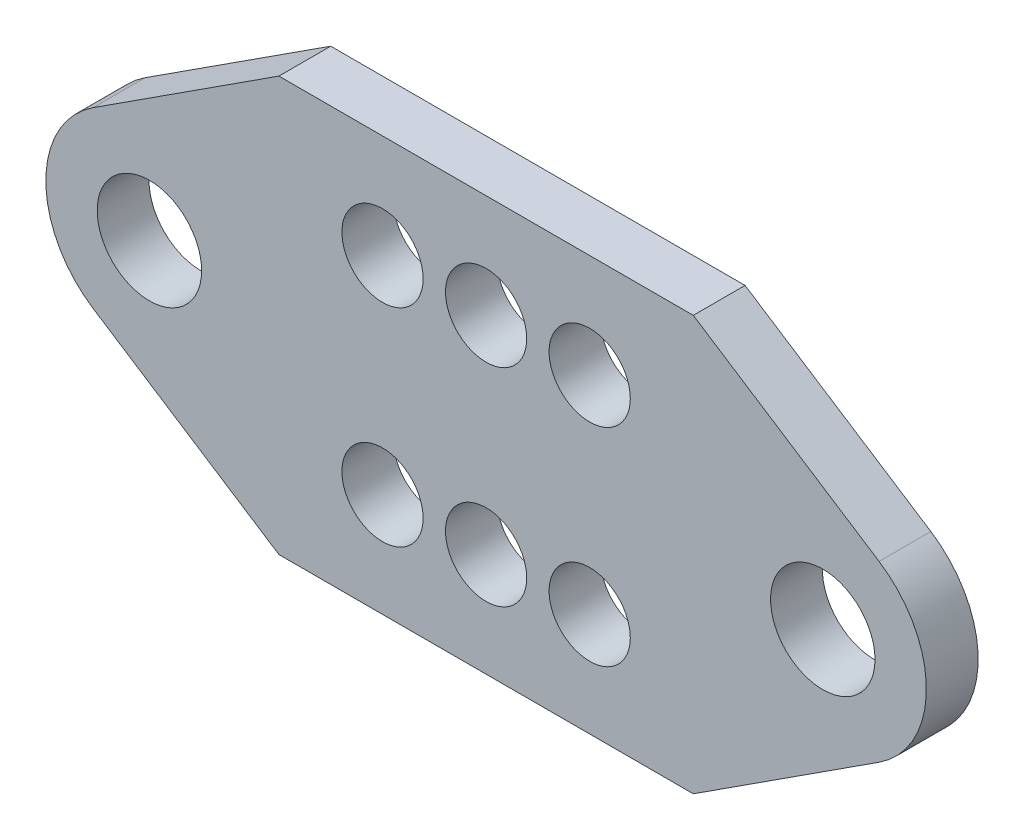
ISO-10303-21;
HEADER;
FILE_DESCRIPTION(('STEP AP214'),'2;1');
FILE_NAME('part.step','',(''),(''),'','','');
FILE_SCHEMA(('AUTOMOTIVE_DESIGN { 1 0 10303 214 1 1 1 1 }'));
ENDSEC;
DATA;
#1=APPLICATION_CONTEXT('core data for automotive mechanical design processes');
#2=APPLICATION_PROTOCOL_DEFINITION('international standard','automotive_design',2000,#1);
#3=PRODUCT_CONTEXT('',#1,'mechanical');
#4=PRODUCT('Part','Part','',(#3));
#5=PRODUCT_RELATED_PRODUCT_CATEGORY('part','',(#4));
#6=PRODUCT_DEFINITION_FORMATION('','',#4);
#7=PRODUCT_DEFINITION_CONTEXT('part definition',#1,'design');
#8=PRODUCT_DEFINITION('design','',#6,#7);
#9=PRODUCT_DEFINITION_SHAPE('','',#8);
#10=(LENGTH_UNIT() NAMED_UNIT(*) SI_UNIT(.MILLI.,.METRE.));
#11=(NAMED_UNIT(*) PLANE_ANGLE_UNIT() SI_UNIT($,.RADIAN.));
#12=(NAMED_UNIT(*) SI_UNIT($,.STERADIAN.) SOLID_ANGLE_UNIT());
#13=UNCERTAINTY_MEASURE_WITH_UNIT(LENGTH_MEASURE(1.E-05),#10,'distance_accuracy_value','');
#14=(GEOMETRIC_REPRESENTATION_CONTEXT(3) GLOBAL_UNCERTAINTY_ASSIGNED_CONTEXT((#13)) GLOBAL_UNIT_ASSIGNED_CONTEXT((#10,
#11,#12)) REPRESENTATION_CONTEXT('',''));
#15=CARTESIAN_POINT('',(0.,0.,0.));
#16=DIRECTION('',(0.,0.,1.));
#17=DIRECTION('',(1.,0.,0.));
#18=AXIS2_PLACEMENT_3D('',#15,#16,#17);
#19=CARTESIAN_POINT('',(-16.343884004258,0.,0.));
#20=DIRECTION('',(0.,0.,1.));
#21=DIRECTION('',(1.,0.,0.));
#22=AXIS2_PLACEMENT_3D('',#19,#20,#21);
#23=PLANE('',#22);
#24=CARTESIAN_POINT('',(20.6375,0.,0.));
#25=DIRECTION('',(0.,0.,1.));
#26=DIRECTION('',(1.,0.,0.));
#27=AXIS2_PLACEMENT_3D('',#24,#25,#26);
#28=CIRCLE('',#27,3.2004);
#29=CARTESIAN_POINT('',(23.8379,0.,0.));
#30=VERTEX_POINT('',#29);
#31=EDGE_CURVE('E167',#30,#30,#28,.T.);
#32=ORIENTED_EDGE('',*,*,#31,.T.);
#33=EDGE_LOOP('',(#32));
#34=FACE_BOUND('',#33,.T.);
#35=CARTESIAN_POINT('',(-20.6375,0.,0.));
#36=DIRECTION('',(0.,0.,1.));
#37=DIRECTION('',(1.,0.,0.));
#38=AXIS2_PLACEMENT_3D('',#35,#36,#37);
#39=CIRCLE('',#38,3.2004);
#40=CARTESIAN_POINT('',(-17.4371,0.,0.));
#41=VERTEX_POINT('',#40);
#42=EDGE_CURVE('E170',#41,#41,#39,.T.);
#43=ORIENTED_EDGE('',*,*,#42,.T.);
#44=EDGE_LOOP('',(#43));
#45=FACE_BOUND('',#44,.T.);
#46=CARTESIAN_POINT('',(6.35,-6.35,0.));
#47=DIRECTION('',(0.,0.,1.));
#48=DIRECTION('',(1.,0.,0.));
#49=AXIS2_PLACEMENT_3D('',#46,#47,#48);
#50=CIRCLE('',#49,2.4892);
#51=CARTESIAN_POINT('',(8.8392,-6.35,0.));
#52=VERTEX_POINT('',#51);
#53=EDGE_CURVE('E173',#52,#52,#50,.T.);
#54=ORIENTED_EDGE('',*,*,#53,.T.);
#55=EDGE_LOOP('',(#54));
#56=FACE_BOUND('',#55,.T.);
#57=CARTESIAN_POINT('',(0.,-6.35,0.));
#58=DIRECTION('',(0.,0.,1.));
#59=DIRECTION('',(1.,0.,0.));
#60=AXIS2_PLACEMENT_3D('',#57,#58,#59);
#61=CIRCLE('',#60,2.4892);
#62=CARTESIAN_POINT('',(2.4892,-6.35,0.));
#63=VERTEX_POINT('',#62);
#64=EDGE_CURVE('E176',#63,#63,#61,.T.);
#65=ORIENTED_EDGE('',*,*,#64,.T.);
#66=EDGE_LOOP('',(#65));
#67=FACE_BOUND('',#66,.T.);
#68=CARTESIAN_POINT('',(-6.35,-6.35,0.));
#69=DIRECTION('',(0.,0.,1.));
#70=DIRECTION('',(1.,0.,0.));
#71=AXIS2_PLACEMENT_3D('',#68,#69,#70);
#72=CIRCLE('',#71,2.4892);
#73=CARTESIAN_POINT('',(-3.8608,-6.35,0.));
#74=VERTEX_POINT('',#73);
#75=EDGE_CURVE('E179',#74,#74,#72,.T.);
#76=ORIENTED_EDGE('',*,*,#75,.T.);
#77=EDGE_LOOP('',(#76));
#78=FACE_BOUND('',#77,.T.);
#79=CARTESIAN_POINT('',(-6.35,6.35,0.));
#80=DIRECTION('',(0.,0.,1.));
#81=DIRECTION('',(1.,0.,0.));
#82=AXIS2_PLACEMENT_3D('',#79,#80,#81);
#83=CIRCLE('',#82,2.4892);
#84=CARTESIAN_POINT('',(-3.8608,6.35,0.));
#85=VERTEX_POINT('',#84);
#86=EDGE_CURVE('E182',#85,#85,#83,.T.);
#87=ORIENTED_EDGE('',*,*,#86,.T.);
#88=EDGE_LOOP('',(#87));
#89=FACE_BOUND('',#88,.T.);
#90=CARTESIAN_POINT('',(0.,6.35,0.));
#91=DIRECTION('',(0.,0.,1.));
#92=DIRECTION('',(1.,0.,0.));
#93=AXIS2_PLACEMENT_3D('',#90,#91,#92);
#94=CIRCLE('',#93,2.4892);
#95=CARTESIAN_POINT('',(2.4892,6.35,0.));
#96=VERTEX_POINT('',#95);
#97=EDGE_CURVE('E185',#96,#96,#94,.T.);
#98=ORIENTED_EDGE('',*,*,#97,.T.);
#99=EDGE_LOOP('',(#98));
#100=FACE_BOUND('',#99,.T.);
#101=CARTESIAN_POINT('',(6.35,6.35,0.));
#102=DIRECTION('',(0.,0.,1.));
#103=DIRECTION('',(1.,0.,0.));
#104=AXIS2_PLACEMENT_3D('',#101,#102,#103);
#105=CIRCLE('',#104,2.4892);
#106=CARTESIAN_POINT('',(8.8392,6.35,0.));
#107=VERTEX_POINT('',#106);
#108=EDGE_CURVE('E188',#107,#107,#105,.T.);
#109=ORIENTED_EDGE('',*,*,#108,.T.);
#110=EDGE_LOOP('',(#109));
#111=FACE_BOUND('',#110,.T.);
#112=CARTESIAN_POINT('',(-20.6375,0.,0.));
#113=DIRECTION('',(0.,0.,1.));
#114=DIRECTION('',(1.,0.,0.));
#115=AXIS2_PLACEMENT_3D('',#112,#113,#114);
#116=CIRCLE('',#115,6.35);
#117=CARTESIAN_POINT('',(-24.0873358456419,5.3311474035262,0.));
#118=VERTEX_POINT('',#117);
#119=CARTESIAN_POINT('',(-24.0873358456419,-5.33114740352619,0.));
#120=VERTEX_POINT('',#119);
#121=EDGE_CURVE('E19',#118,#120,#116,.T.);
#122=ORIENTED_EDGE('',*,*,#121,.F.);
#123=DIRECTION('',(-0.83955077220885,-0.54328123553416,0.));
#124=VECTOR('',#123,1.);
#125=CARTESIAN_POINT('',(-12.7,12.7,0.));
#126=LINE('',#125,#124);
#127=CARTESIAN_POINT('',(-12.7,12.7,0.));
#128=VERTEX_POINT('',#127);
#129=EDGE_CURVE('E78',#128,#118,#126,.T.);
#130=ORIENTED_EDGE('',*,*,#129,.F.);
#131=DIRECTION('',(-1.,0.,0.));
#132=VECTOR('',#131,1.);
#133=CARTESIAN_POINT('',(12.7,12.7,0.));
#134=LINE('',#133,#132);
#135=CARTESIAN_POINT('',(12.7,12.7,0.));
#136=VERTEX_POINT('',#135);
#137=EDGE_CURVE('E113',#136,#128,#134,.T.);
#138=ORIENTED_EDGE('',*,*,#137,.F.);
#139=DIRECTION('',(-0.83955077220885,0.54328123553416,0.));
#140=VECTOR('',#139,1.);
#141=CARTESIAN_POINT('',(24.0873358456419,5.33114740352621,0.));
#142=LINE('',#141,#140);
#143=CARTESIAN_POINT('',(24.0873358456419,5.33114740352621,0.));
#144=VERTEX_POINT('',#143);
#145=EDGE_CURVE('E116',#144,#136,#142,.T.);
#146=ORIENTED_EDGE('',*,*,#145,.F.);
#147=CARTESIAN_POINT('',(20.6375,0.,0.));
#148=DIRECTION('',(0.,0.,1.));
#149=DIRECTION('',(1.,0.,0.));
#150=AXIS2_PLACEMENT_3D('',#147,#148,#149);
#151=CIRCLE('',#150,6.35);
#152=CARTESIAN_POINT('',(24.0873358456419,-5.33114740352619,0.));
#153=VERTEX_POINT('',#152);
#154=EDGE_CURVE('E119',#153,#144,#151,.T.);
#155=ORIENTED_EDGE('',*,*,#154,.F.);
#156=DIRECTION('',(0.83955077220885,0.54328123553416,0.));
#157=VECTOR('',#156,1.);
#158=CARTESIAN_POINT('',(12.7,-12.7,0.));
#159=LINE('',#158,#157);
#160=CARTESIAN_POINT('',(12.7,-12.7,0.));
#161=VERTEX_POINT('',#160);
#162=EDGE_CURVE('E129',#161,#153,#159,.T.);
#163=ORIENTED_EDGE('',*,*,#162,.F.);
#164=DIRECTION('',(1.,0.,0.));
#165=VECTOR('',#164,1.);
#166=CARTESIAN_POINT('',(-12.7,-12.7,0.));
#167=LINE('',#166,#165);
#168=CARTESIAN_POINT('',(-12.7,-12.7,0.));
#169=VERTEX_POINT('',#168);
#170=EDGE_CURVE('E87',#169,#161,#167,.T.);
#171=ORIENTED_EDGE('',*,*,#170,.F.);
#172=DIRECTION('',(0.83955077220885,-0.54328123553416,0.));
#173=VECTOR('',#172,1.);
#174=CARTESIAN_POINT('',(-24.0873358456419,-5.33114740352618,0.));
#175=LINE('',#174,#173);
#176=EDGE_CURVE('E83',#120,#169,#175,.T.);
#177=ORIENTED_EDGE('',*,*,#176,.F.);
#178=EDGE_LOOP('',(#122,#130,#138,#146,#155,#163,#171,#177));
#179=FACE_BOUND('',#178,.T.);
#180=ADVANCED_FACE('F16',(#34,#45,#56,#67,#78,#89,#100,#111,#179),#23,.F.);
#181=CARTESIAN_POINT('',(-12.7,12.7,0.));
#182=DIRECTION('',(-0.54328123553416,0.83955077220885,0.));
#183=DIRECTION('',(-0.83955077220885,-0.54328123553416,0.));
#184=AXIS2_PLACEMENT_3D('',#181,#182,#183);
#185=PLANE('',#184);
#186=DIRECTION('',(-0.83955077220885,-0.543281235534159,0.));
#187=VECTOR('',#186,1.);
#188=CARTESIAN_POINT('',(-12.7,12.7,3.175));
#189=LINE('',#188,#187);
#190=CARTESIAN_POINT('',(-12.7,12.7,3.175));
#191=VERTEX_POINT('',#190);
#192=CARTESIAN_POINT('',(-24.0873358456419,5.33114740352621,3.175));
#193=VERTEX_POINT('',#192);
#194=EDGE_CURVE('E166',#191,#193,#189,.T.);
#195=ORIENTED_EDGE('',*,*,#194,.F.);
#196=DIRECTION('',(0.,0.,1.));
#197=VECTOR('',#196,1.);
#198=CARTESIAN_POINT('',(-12.7,12.7,0.));
#199=LINE('',#198,#197);
#200=EDGE_CURVE('E110',#128,#191,#199,.T.);
#201=ORIENTED_EDGE('',*,*,#200,.F.);
#202=ORIENTED_EDGE('',*,*,#129,.T.);
#203=DIRECTION('',(0.,0.,1.));
#204=VECTOR('',#203,1.);
#205=CARTESIAN_POINT('',(-24.0873358456419,5.3311474035262,0.));
#206=LINE('',#205,#204);
#207=EDGE_CURVE('E97',#193,#118,#206,.F.);
#208=ORIENTED_EDGE('',*,*,#207,.F.);
#209=EDGE_LOOP('',(#195,#201,#202,#208));
#210=FACE_BOUND('',#209,.T.);
#211=ADVANCED_FACE('F242',(#210),#185,.T.);
#212=CARTESIAN_POINT('',(-20.6375,0.,0.));
#213=DIRECTION('',(0.,0.,1.));
#214=DIRECTION('',(1.,0.,0.));
#215=AXIS2_PLACEMENT_3D('',#212,#213,#214);
#216=CYLINDRICAL_SURFACE('',#215,6.35);
#217=ORIENTED_EDGE('',*,*,#207,.T.);
#218=ORIENTED_EDGE('',*,*,#121,.T.);
#219=DIRECTION('',(0.,0.,1.));
#220=VECTOR('',#219,1.);
#221=CARTESIAN_POINT('',(-24.0873358456419,-5.33114740352618,0.));
#222=LINE('',#221,#220);
#223=CARTESIAN_POINT('',(-24.0873358456419,-5.33114740352618,3.175));
#224=VERTEX_POINT('',#223);
#225=EDGE_CURVE('E91',#224,#120,#222,.F.);
#226=ORIENTED_EDGE('',*,*,#225,.F.);
#227=CARTESIAN_POINT('',(-20.6375,0.,3.175));
#228=DIRECTION('',(0.,0.,1.));
#229=DIRECTION('',(1.,0.,0.));
#230=AXIS2_PLACEMENT_3D('',#227,#228,#229);
#231=CIRCLE('',#230,6.35);
#232=EDGE_CURVE('E164',#193,#224,#231,.T.);
#233=ORIENTED_EDGE('',*,*,#232,.F.);
#234=EDGE_LOOP('',(#217,#218,#226,#233));
#235=FACE_BOUND('',#234,.T.);
#236=ADVANCED_FACE('F94',(#235),#216,.T.);
#237=CARTESIAN_POINT('',(-24.0873358456419,-5.33114740352618,0.));
#238=DIRECTION('',(-0.54328123553416,-0.83955077220885,0.));
#239=DIRECTION('',(0.83955077220885,-0.54328123553416,0.));
#240=AXIS2_PLACEMENT_3D('',#237,#238,#239);
#241=PLANE('',#240);
#242=DIRECTION('',(0.83955077220885,-0.543281235534161,0.));
#243=VECTOR('',#242,1.);
#244=CARTESIAN_POINT('',(-24.0873358456419,-5.33114740352618,3.175));
#245=LINE('',#244,#243);
#246=CARTESIAN_POINT('',(-12.7,-12.7,3.175));
#247=VERTEX_POINT('',#246);
#248=EDGE_CURVE('E100',#224,#247,#245,.T.);
#249=ORIENTED_EDGE('',*,*,#248,.F.);
#250=ORIENTED_EDGE('',*,*,#225,.T.);
#251=ORIENTED_EDGE('',*,*,#176,.T.);
#252=DIRECTION('',(0.,0.,-1.));
#253=VECTOR('',#252,1.);
#254=CARTESIAN_POINT('',(-12.7,-12.7,0.));
#255=LINE('',#254,#253);
#256=EDGE_CURVE('E103',#247,#169,#255,.T.);
#257=ORIENTED_EDGE('',*,*,#256,.F.);
#258=EDGE_LOOP('',(#249,#250,#251,#257));
#259=FACE_BOUND('',#258,.T.);
#260=ADVANCED_FACE('F98',(#259),#241,.T.);
#261=CARTESIAN_POINT('',(-12.7,-12.7,0.));
#262=DIRECTION('',(0.,-1.,0.));
#263=DIRECTION('',(0.,0.,-1.));
#264=AXIS2_PLACEMENT_3D('',#261,#262,#263);
#265=PLANE('',#264);
#266=DIRECTION('',(1.,0.,0.));
#267=VECTOR('',#266,1.);
#268=CARTESIAN_POINT('',(-16.343884004258,-12.7,3.175));
#269=LINE('',#268,#267);
#270=CARTESIAN_POINT('',(12.7,-12.7,3.175));
#271=VERTEX_POINT('',#270);
#272=EDGE_CURVE('E206',#247,#271,#269,.T.);
#273=ORIENTED_EDGE('',*,*,#272,.F.);
#274=ORIENTED_EDGE('',*,*,#256,.T.);
#275=ORIENTED_EDGE('',*,*,#170,.T.);
#276=DIRECTION('',(0.,0.,1.));
#277=VECTOR('',#276,1.);
#278=CARTESIAN_POINT('',(12.7,-12.7,0.));
#279=LINE('',#278,#277);
#280=EDGE_CURVE('E131',#271,#161,#279,.F.);
#281=ORIENTED_EDGE('',*,*,#280,.F.);
#282=EDGE_LOOP('',(#273,#274,#275,#281));
#283=FACE_BOUND('',#282,.T.);
#284=ADVANCED_FACE('F212',(#283),#265,.T.);
#285=CARTESIAN_POINT('',(12.7,-12.7,0.));
#286=DIRECTION('',(0.54328123553416,-0.83955077220885,0.));
#287=DIRECTION('',(0.83955077220885,0.54328123553416,0.));
#288=AXIS2_PLACEMENT_3D('',#285,#286,#287);
#289=PLANE('',#288);
#290=DIRECTION('',(0.83955077220885,0.543281235534161,0.));
#291=VECTOR('',#290,1.);
#292=CARTESIAN_POINT('',(12.7,-12.7,3.175));
#293=LINE('',#292,#291);
#294=CARTESIAN_POINT('',(24.0873358456419,-5.33114740352619,3.175));
#295=VERTEX_POINT('',#294);
#296=EDGE_CURVE('E163',#271,#295,#293,.T.);
#297=ORIENTED_EDGE('',*,*,#296,.F.);
#298=ORIENTED_EDGE('',*,*,#280,.T.);
#299=ORIENTED_EDGE('',*,*,#162,.T.);
#300=DIRECTION('',(0.,0.,1.));
#301=VECTOR('',#300,1.);
#302=CARTESIAN_POINT('',(24.0873358456419,-5.33114740352619,0.));
#303=LINE('',#302,#301);
#304=EDGE_CURVE('E191',#295,#153,#303,.F.);
#305=ORIENTED_EDGE('',*,*,#304,.F.);
#306=EDGE_LOOP('',(#297,#298,#299,#305));
#307=FACE_BOUND('',#306,.T.);
#308=ADVANCED_FACE('F239',(#307),#289,.T.);
#309=CARTESIAN_POINT('',(20.6375,0.,0.));
#310=DIRECTION('',(0.,0.,1.));
#311=DIRECTION('',(1.,0.,0.));
#312=AXIS2_PLACEMENT_3D('',#309,#310,#311);
#313=CYLINDRICAL_SURFACE('',#312,6.35);
#314=ORIENTED_EDGE('',*,*,#304,.T.);
#315=ORIENTED_EDGE('',*,*,#154,.T.);
#316=DIRECTION('',(0.,0.,1.));
#317=VECTOR('',#316,1.);
#318=CARTESIAN_POINT('',(24.0873358456419,5.33114740352621,0.));
#319=LINE('',#318,#317);
#320=CARTESIAN_POINT('',(24.0873358456419,5.33114740352621,3.175));
#321=VERTEX_POINT('',#320);
#322=EDGE_CURVE('E118',#321,#144,#319,.F.);
#323=ORIENTED_EDGE('',*,*,#322,.F.);
#324=CARTESIAN_POINT('',(20.6375,0.,3.175));
#325=DIRECTION('',(0.,0.,1.));
#326=DIRECTION('',(1.,0.,0.));
#327=AXIS2_PLACEMENT_3D('',#324,#325,#326);
#328=CIRCLE('',#327,6.35);
#329=EDGE_CURVE('E159',#295,#321,#328,.T.);
#330=ORIENTED_EDGE('',*,*,#329,.F.);
#331=EDGE_LOOP('',(#314,#315,#323,#330));
#332=FACE_BOUND('',#331,.T.);
#333=ADVANCED_FACE('F240',(#332),#313,.T.);
#334=CARTESIAN_POINT('',(24.0873358456419,5.33114740352621,0.));
#335=DIRECTION('',(0.54328123553416,0.83955077220885,0.));
#336=DIRECTION('',(-0.83955077220885,0.54328123553416,0.));
#337=AXIS2_PLACEMENT_3D('',#334,#335,#336);
#338=PLANE('',#337);
#339=DIRECTION('',(-0.83955077220885,0.543281235534159,0.));
#340=VECTOR('',#339,1.);
#341=CARTESIAN_POINT('',(24.0873358456419,5.33114740352621,3.175));
#342=LINE('',#341,#340);
#343=CARTESIAN_POINT('',(12.7,12.7,3.175));
#344=VERTEX_POINT('',#343);
#345=EDGE_CURVE('E162',#321,#344,#342,.T.);
#346=ORIENTED_EDGE('',*,*,#345,.F.);
#347=ORIENTED_EDGE('',*,*,#322,.T.);
#348=ORIENTED_EDGE('',*,*,#145,.T.);
#349=DIRECTION('',(0.,0.,1.));
#350=VECTOR('',#349,1.);
#351=CARTESIAN_POINT('',(12.7,12.7,0.));
#352=LINE('',#351,#350);
#353=EDGE_CURVE('E34',#344,#136,#352,.F.);
#354=ORIENTED_EDGE('',*,*,#353,.F.);
#355=EDGE_LOOP('',(#346,#347,#348,#354));
#356=FACE_BOUND('',#355,.T.);
#357=ADVANCED_FACE('F241',(#356),#338,.T.);
#358=CARTESIAN_POINT('',(12.7,12.7,0.));
#359=DIRECTION('',(0.,1.,0.));
#360=DIRECTION('',(-1.,0.,0.));
#361=AXIS2_PLACEMENT_3D('',#358,#359,#360);
#362=PLANE('',#361);
#363=DIRECTION('',(1.,0.,0.));
#364=VECTOR('',#363,1.);
#365=CARTESIAN_POINT('',(-16.343884004258,12.7,3.175));
#366=LINE('',#365,#364);
#367=EDGE_CURVE('E158',#344,#191,#366,.F.);
#368=ORIENTED_EDGE('',*,*,#367,.F.);
#369=ORIENTED_EDGE('',*,*,#353,.T.);
#370=ORIENTED_EDGE('',*,*,#137,.T.);
#371=ORIENTED_EDGE('',*,*,#200,.T.);
#372=EDGE_LOOP('',(#368,#369,#370,#371));
#373=FACE_BOUND('',#372,.T.);
#374=ADVANCED_FACE('F234',(#373),#362,.T.);
#375=CARTESIAN_POINT('',(6.35,6.35,-56.5622685180701));
#376=DIRECTION('',(0.,0.,1.));
#377=DIRECTION('',(1.,0.,0.));
#378=AXIS2_PLACEMENT_3D('',#375,#376,#377);
#379=CYLINDRICAL_SURFACE('',#378,2.4892);
#380=CARTESIAN_POINT('',(6.35,6.35,3.175));
#381=DIRECTION('',(0.,0.,1.));
#382=DIRECTION('',(1.,0.,0.));
#383=AXIS2_PLACEMENT_3D('',#380,#381,#382);
#384=CIRCLE('',#383,2.4892);
#385=CARTESIAN_POINT('',(8.8392,6.35,3.175));
#386=VERTEX_POINT('',#385);
#387=EDGE_CURVE('E155',#386,#386,#384,.F.);
#388=ORIENTED_EDGE('',*,*,#387,.F.);
#389=EDGE_LOOP('',(#388));
#390=FACE_BOUND('',#389,.T.);
#391=ORIENTED_EDGE('',*,*,#108,.F.);
#392=EDGE_LOOP('',(#391));
#393=FACE_BOUND('',#392,.T.);
#394=ADVANCED_FACE('F285',(#390,#393),#379,.F.);
#395=CARTESIAN_POINT('',(0.,6.35,-56.5622685180701));
#396=DIRECTION('',(0.,0.,1.));
#397=DIRECTION('',(1.,0.,0.));
#398=AXIS2_PLACEMENT_3D('',#395,#396,#397);
#399=CYLINDRICAL_SURFACE('',#398,2.4892);
#400=CARTESIAN_POINT('',(0.,6.35,3.175));
#401=DIRECTION('',(0.,0.,1.));
#402=DIRECTION('',(1.,0.,0.));
#403=AXIS2_PLACEMENT_3D('',#400,#401,#402);
#404=CIRCLE('',#403,2.4892);
#405=CARTESIAN_POINT('',(2.4892,6.35,3.175));
#406=VERTEX_POINT('',#405);
#407=EDGE_CURVE('E152',#406,#406,#404,.F.);
#408=ORIENTED_EDGE('',*,*,#407,.F.);
#409=EDGE_LOOP('',(#408));
#410=FACE_BOUND('',#409,.T.);
#411=ORIENTED_EDGE('',*,*,#97,.F.);
#412=EDGE_LOOP('',(#411));
#413=FACE_BOUND('',#412,.T.);
#414=ADVANCED_FACE('F281',(#410,#413),#399,.F.);
#415=CARTESIAN_POINT('',(-6.35,6.35,-56.5622685180701));
#416=DIRECTION('',(0.,0.,1.));
#417=DIRECTION('',(1.,0.,0.));
#418=AXIS2_PLACEMENT_3D('',#415,#416,#417);
#419=CYLINDRICAL_SURFACE('',#418,2.4892);
#420=CARTESIAN_POINT('',(-6.35,6.35,3.175));
#421=DIRECTION('',(0.,0.,1.));
#422=DIRECTION('',(1.,0.,0.));
#423=AXIS2_PLACEMENT_3D('',#420,#421,#422);
#424=CIRCLE('',#423,2.4892);
#425=CARTESIAN_POINT('',(-3.8608,6.35,3.175));
#426=VERTEX_POINT('',#425);
#427=EDGE_CURVE('E149',#426,#426,#424,.F.);
#428=ORIENTED_EDGE('',*,*,#427,.F.);
#429=EDGE_LOOP('',(#428));
#430=FACE_BOUND('',#429,.T.);
#431=ORIENTED_EDGE('',*,*,#86,.F.);
#432=EDGE_LOOP('',(#431));
#433=FACE_BOUND('',#432,.T.);
#434=ADVANCED_FACE('F277',(#430,#433),#419,.F.);
#435=CARTESIAN_POINT('',(-6.35,-6.35,-56.5622685180701));
#436=DIRECTION('',(0.,0.,1.));
#437=DIRECTION('',(1.,0.,0.));
#438=AXIS2_PLACEMENT_3D('',#435,#436,#437);
#439=CYLINDRICAL_SURFACE('',#438,2.4892);
#440=CARTESIAN_POINT('',(-6.35,-6.35,3.175));
#441=DIRECTION('',(0.,0.,1.));
#442=DIRECTION('',(1.,0.,0.));
#443=AXIS2_PLACEMENT_3D('',#440,#441,#442);
#444=CIRCLE('',#443,2.4892);
#445=CARTESIAN_POINT('',(-3.8608,-6.35,3.175));
#446=VERTEX_POINT('',#445);
#447=EDGE_CURVE('E146',#446,#446,#444,.F.);
#448=ORIENTED_EDGE('',*,*,#447,.F.);
#449=EDGE_LOOP('',(#448));
#450=FACE_BOUND('',#449,.T.);
#451=ORIENTED_EDGE('',*,*,#75,.F.);
#452=EDGE_LOOP('',(#451));
#453=FACE_BOUND('',#452,.T.);
#454=ADVANCED_FACE('F273',(#450,#453),#439,.F.);
#455=CARTESIAN_POINT('',(0.,-6.35,-56.5622685180701));
#456=DIRECTION('',(0.,0.,1.));
#457=DIRECTION('',(1.,0.,0.));
#458=AXIS2_PLACEMENT_3D('',#455,#456,#457);
#459=CYLINDRICAL_SURFACE('',#458,2.4892);
#460=CARTESIAN_POINT('',(0.,-6.35,3.175));
#461=DIRECTION('',(0.,0.,1.));
#462=DIRECTION('',(1.,0.,0.));
#463=AXIS2_PLACEMENT_3D('',#460,#461,#462);
#464=CIRCLE('',#463,2.4892);
#465=CARTESIAN_POINT('',(2.4892,-6.35,3.175));
#466=VERTEX_POINT('',#465);
#467=EDGE_CURVE('E143',#466,#466,#464,.F.);
#468=ORIENTED_EDGE('',*,*,#467,.F.);
#469=EDGE_LOOP('',(#468));
#470=FACE_BOUND('',#469,.T.);
#471=ORIENTED_EDGE('',*,*,#64,.F.);
#472=EDGE_LOOP('',(#471));
#473=FACE_BOUND('',#472,.T.);
#474=ADVANCED_FACE('F269',(#470,#473),#459,.F.);
#475=CARTESIAN_POINT('',(6.35,-6.35,-56.5622685180701));
#476=DIRECTION('',(0.,0.,1.));
#477=DIRECTION('',(1.,0.,0.));
#478=AXIS2_PLACEMENT_3D('',#475,#476,#477);
#479=CYLINDRICAL_SURFACE('',#478,2.4892);
#480=CARTESIAN_POINT('',(6.35,-6.35,3.175));
#481=DIRECTION('',(0.,0.,1.));
#482=DIRECTION('',(1.,0.,0.));
#483=AXIS2_PLACEMENT_3D('',#480,#481,#482);
#484=CIRCLE('',#483,2.4892);
#485=CARTESIAN_POINT('',(8.8392,-6.35,3.175));
#486=VERTEX_POINT('',#485);
#487=EDGE_CURVE('E140',#486,#486,#484,.F.);
#488=ORIENTED_EDGE('',*,*,#487,.F.);
#489=EDGE_LOOP('',(#488));
#490=FACE_BOUND('',#489,.T.);
#491=ORIENTED_EDGE('',*,*,#53,.F.);
#492=EDGE_LOOP('',(#491));
#493=FACE_BOUND('',#492,.T.);
#494=ADVANCED_FACE('F265',(#490,#493),#479,.F.);
#495=CARTESIAN_POINT('',(-20.6375,0.,-56.5622685180701));
#496=DIRECTION('',(0.,0.,1.));
#497=DIRECTION('',(1.,0.,0.));
#498=AXIS2_PLACEMENT_3D('',#495,#496,#497);
#499=CYLINDRICAL_SURFACE('',#498,3.2004);
#500=CARTESIAN_POINT('',(-20.6375,0.,3.175));
#501=DIRECTION('',(0.,0.,1.));
#502=DIRECTION('',(1.,0.,0.));
#503=AXIS2_PLACEMENT_3D('',#500,#501,#502);
#504=CIRCLE('',#503,3.2004);
#505=CARTESIAN_POINT('',(-17.4371,0.,3.175));
#506=VERTEX_POINT('',#505);
#507=EDGE_CURVE('E25',#506,#506,#504,.F.);
#508=ORIENTED_EDGE('',*,*,#507,.F.);
#509=EDGE_LOOP('',(#508));
#510=FACE_BOUND('',#509,.T.);
#511=ORIENTED_EDGE('',*,*,#42,.F.);
#512=EDGE_LOOP('',(#511));
#513=FACE_BOUND('',#512,.T.);
#514=ADVANCED_FACE('F258',(#510,#513),#499,.F.);
#515=CARTESIAN_POINT('',(20.6375,0.,-56.5622685180701));
#516=DIRECTION('',(0.,0.,1.));
#517=DIRECTION('',(1.,0.,0.));
#518=AXIS2_PLACEMENT_3D('',#515,#516,#517);
#519=CYLINDRICAL_SURFACE('',#518,3.2004);
#520=CARTESIAN_POINT('',(20.6375,0.,3.175));
#521=DIRECTION('',(0.,0.,1.));
#522=DIRECTION('',(1.,0.,0.));
#523=AXIS2_PLACEMENT_3D('',#520,#521,#522);
#524=CIRCLE('',#523,3.2004);
#525=CARTESIAN_POINT('',(23.8379,0.,3.175));
#526=VERTEX_POINT('',#525);
#527=EDGE_CURVE('E10',#526,#526,#524,.F.);
#528=ORIENTED_EDGE('',*,*,#527,.F.);
#529=EDGE_LOOP('',(#528));
#530=FACE_BOUND('',#529,.T.);
#531=ORIENTED_EDGE('',*,*,#31,.F.);
#532=EDGE_LOOP('',(#531));
#533=FACE_BOUND('',#532,.T.);
#534=ADVANCED_FACE('F252',(#530,#533),#519,.F.);
#535=CARTESIAN_POINT('',(-16.343884004258,0.,3.175));
#536=DIRECTION('',(0.,0.,1.));
#537=DIRECTION('',(1.,0.,0.));
#538=AXIS2_PLACEMENT_3D('',#535,#536,#537);
#539=PLANE('',#538);
#540=ORIENTED_EDGE('',*,*,#527,.T.);
#541=EDGE_LOOP('',(#540));
#542=FACE_BOUND('',#541,.T.);
#543=ORIENTED_EDGE('',*,*,#507,.T.);
#544=EDGE_LOOP('',(#543));
#545=FACE_BOUND('',#544,.T.);
#546=ORIENTED_EDGE('',*,*,#487,.T.);
#547=EDGE_LOOP('',(#546));
#548=FACE_BOUND('',#547,.T.);
#549=ORIENTED_EDGE('',*,*,#467,.T.);
#550=EDGE_LOOP('',(#549));
#551=FACE_BOUND('',#550,.T.);
#552=ORIENTED_EDGE('',*,*,#447,.T.);
#553=EDGE_LOOP('',(#552));
#554=FACE_BOUND('',#553,.T.);
#555=ORIENTED_EDGE('',*,*,#427,.T.);
#556=EDGE_LOOP('',(#555));
#557=FACE_BOUND('',#556,.T.);
#558=ORIENTED_EDGE('',*,*,#407,.T.);
#559=EDGE_LOOP('',(#558));
#560=FACE_BOUND('',#559,.T.);
#561=ORIENTED_EDGE('',*,*,#387,.T.);
#562=EDGE_LOOP('',(#561));
#563=FACE_BOUND('',#562,.T.);
#564=ORIENTED_EDGE('',*,*,#345,.T.);
#565=ORIENTED_EDGE('',*,*,#367,.T.);
#566=ORIENTED_EDGE('',*,*,#194,.T.);
#567=ORIENTED_EDGE('',*,*,#232,.T.);
#568=ORIENTED_EDGE('',*,*,#248,.T.);
#569=ORIENTED_EDGE('',*,*,#272,.T.);
#570=ORIENTED_EDGE('',*,*,#296,.T.);
#571=ORIENTED_EDGE('',*,*,#329,.T.);
#572=EDGE_LOOP('',(#564,#565,#566,#567,#568,#569,#570,#571));
#573=FACE_BOUND('',#572,.T.);
#574=ADVANCED_FACE('F217',(#542,#545,#548,#551,#554,#557,#560,#563,#573),#539,.T.);
#575=CLOSED_SHELL('',(#180,#211,#236,#260,#284,#308,#333,#357,#374,#394,#414,#434,#454,#474,
#494,#514,#534,#574));
#576=MANIFOLD_SOLID_BREP('B1',#575);
#577=ADVANCED_BREP_SHAPE_REPRESENTATION('',(#18,#576),#14);
#578=SHAPE_DEFINITION_REPRESENTATION(#9,#577);
ENDSEC;
END-ISO-10303-21;
